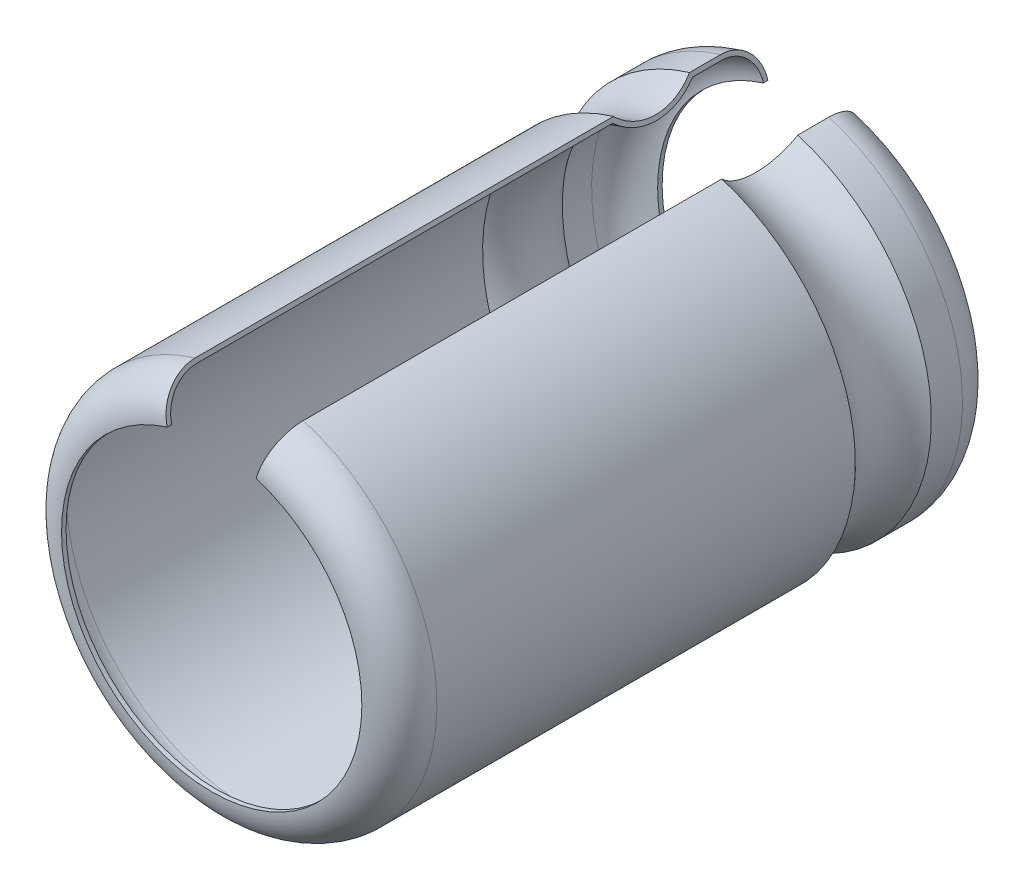
ISO-10303-21;
HEADER;
FILE_DESCRIPTION(('STEP AP214'),'2;1');
FILE_NAME('part.step','',(''),(''),'','','');
FILE_SCHEMA(('AUTOMOTIVE_DESIGN { 1 0 10303 214 1 1 1 1 }'));
ENDSEC;
DATA;
#1=APPLICATION_CONTEXT('core data for automotive mechanical design processes');
#2=APPLICATION_PROTOCOL_DEFINITION('international standard','automotive_design',2000,#1);
#3=PRODUCT_CONTEXT('',#1,'mechanical');
#4=PRODUCT('Part','Part','',(#3));
#5=PRODUCT_RELATED_PRODUCT_CATEGORY('part','',(#4));
#6=PRODUCT_DEFINITION_FORMATION('','',#4);
#7=PRODUCT_DEFINITION_CONTEXT('part definition',#1,'design');
#8=PRODUCT_DEFINITION('design','',#6,#7);
#9=PRODUCT_DEFINITION_SHAPE('','',#8);
#10=(LENGTH_UNIT() NAMED_UNIT(*) SI_UNIT(.MILLI.,.METRE.));
#11=(NAMED_UNIT(*) PLANE_ANGLE_UNIT() SI_UNIT($,.RADIAN.));
#12=(NAMED_UNIT(*) SI_UNIT($,.STERADIAN.) SOLID_ANGLE_UNIT());
#13=UNCERTAINTY_MEASURE_WITH_UNIT(LENGTH_MEASURE(1.E-05),#10,'distance_accuracy_value','');
#14=(GEOMETRIC_REPRESENTATION_CONTEXT(3) GLOBAL_UNCERTAINTY_ASSIGNED_CONTEXT((#13)) GLOBAL_UNIT_ASSIGNED_CONTEXT((#10,
#11,#12)) REPRESENTATION_CONTEXT('',''));
#15=CARTESIAN_POINT('',(0.,0.,0.));
#16=DIRECTION('',(0.,0.,1.));
#17=DIRECTION('',(1.,0.,0.));
#18=AXIS2_PLACEMENT_3D('',#15,#16,#17);
#19=CARTESIAN_POINT('',(-175.270710986926,-62.9180736437961,-7.00000000000005));
#20=DIRECTION('',(0.,0.,-1.));
#21=DIRECTION('',(-1.,0.,0.));
#22=AXIS2_PLACEMENT_3D('',#19,#20,#21);
#23=TOROIDAL_SURFACE('',#22,3.99999999999992,0.879999999999994);
#24=CARTESIAN_POINT('',(-174.086691240548,-59.0973280045019,-7.88000000000005));
#25=CARTESIAN_POINT('',(-174.073863625486,-59.049454693351,-7.88004200739849));
#26=CARTESIAN_POINT('',(-174.061039158918,-59.001593132538,-7.87582172400537));
#27=CARTESIAN_POINT('',(-174.035762350138,-58.907258797918,-7.8591646886519));
#28=CARTESIAN_POINT('',(-174.023309732605,-58.8607849966003,-7.84673418162917));
#29=CARTESIAN_POINT('',(-173.999115912304,-58.7704924300049,-7.81395587498221));
#30=CARTESIAN_POINT('',(-173.987375063362,-58.7266749852309,-7.79360417434748));
#31=CARTESIAN_POINT('',(-173.964946807082,-58.6429715932675,-7.74557704096647));
#32=CARTESIAN_POINT('',(-173.954259206179,-58.6030849236881,-7.7179029573711));
#33=CARTESIAN_POINT('',(-173.934243494534,-58.5283852708782,-7.65602370187232));
#34=CARTESIAN_POINT('',(-173.924914806908,-58.4935701346889,-7.62182131568306));
#35=CARTESIAN_POINT('',(-173.907875166683,-58.4299773316266,-7.54783977454284));
#36=CARTESIAN_POINT('',(-173.900164530168,-58.4012008443949,-7.50805953249298));
#37=CARTESIAN_POINT('',(-173.886585843482,-58.3505244957839,-7.42407942411352));
#38=CARTESIAN_POINT('',(-173.880717076708,-58.3286219600042,-7.37988128547069));
#39=CARTESIAN_POINT('',(-173.870987368497,-58.2923101946186,-7.28831316894348));
#40=CARTESIAN_POINT('',(-173.867125235586,-58.2778965183701,-7.24094509217138));
#41=CARTESIAN_POINT('',(-173.862482732615,-58.2605704614063,-7.16107038915282));
#42=CARTESIAN_POINT('',(-173.861099001353,-58.2554063060326,-7.12906788225587));
#43=CARTESIAN_POINT('',(-173.859253042378,-58.2485170933492,-7.06471473974938));
#44=CARTESIAN_POINT('',(-173.858789506993,-58.2467871557412,-7.03236466393462));
#45=CARTESIAN_POINT('',(-173.858790560804,-58.2467910886193,-7.00000000000003));
#46=B_SPLINE_CURVE_WITH_KNOTS('',3,(#24,#25,#26,#27,#28,#29,#30,#31,#32,#33,#34,#35,#36,#37,#38,
#39,#40,#41,#42,#43,#44,#45),.UNSPECIFIED.,.F.,.F.,(4,2,2,2,2,2,2,2,2,2,4),(0.,
0.148489542652124,0.296866269659267,0.445316161530129,0.593738720494428,0.742098086583743,
0.890486407537572,1.03881692430446,1.18705926626675,1.28421349755417,1.38122956579012),.UNSPECIFIED.);
#47=CARTESIAN_POINT('',(-174.086691240548,-59.0973280045019,-7.88000000000004));
#48=VERTEX_POINT('',#47);
#49=CARTESIAN_POINT('',(-173.858790560804,-58.2467910886192,-7.00000000000003));
#50=VERTEX_POINT('',#49);
#51=EDGE_CURVE('E120',#48,#50,#46,.T.);
#52=ORIENTED_EDGE('',*,*,#51,.F.);
#53=CARTESIAN_POINT('',(-175.270710986926,-62.9180736437962,-7.88000000000003));
#54=DIRECTION('',(0.,0.,-1.));
#55=DIRECTION('',(-1.,0.,0.));
#56=AXIS2_PLACEMENT_3D('',#53,#54,#55);
#57=CIRCLE('',#56,4.);
#58=CARTESIAN_POINT('',(-176.454730733284,-59.0973280044957,-7.88000000000003));
#59=VERTEX_POINT('',#58);
#60=EDGE_CURVE('E119',#48,#59,#57,.T.);
#61=ORIENTED_EDGE('',*,*,#60,.T.);
#62=CARTESIAN_POINT('',(-176.682631413028,-58.2467910886134,-7.00000000000003));
#63=CARTESIAN_POINT('',(-176.682642318182,-58.2467503900244,-7.04948823001555));
#64=CARTESIAN_POINT('',(-176.681551062634,-58.2508230111739,-7.09896377495482));
#65=CARTESIAN_POINT('',(-176.677244738356,-58.2668944321743,-7.19647661285873));
#66=CARTESIAN_POINT('',(-176.674031362662,-58.2788869135261,-7.24451502046828));
#67=CARTESIAN_POINT('',(-176.665559054278,-58.3105059988744,-7.33784616668078));
#68=CARTESIAN_POINT('',(-176.660299148075,-58.3301362360651,-7.38313758670326));
#69=CARTESIAN_POINT('',(-176.647887971262,-58.3764553785155,-7.46965947469887));
#70=CARTESIAN_POINT('',(-176.640737027326,-58.4031430646066,-7.51089064239059));
#71=CARTESIAN_POINT('',(-176.624744283447,-58.4628287973129,-7.58813912651197));
#72=CARTESIAN_POINT('',(-176.615902167139,-58.4958280246216,-7.62415546519043));
#73=CARTESIAN_POINT('',(-176.596777125269,-58.5672036525786,-7.68995197242969));
#74=CARTESIAN_POINT('',(-176.586493918243,-58.6055811036625,-7.71973091990715));
#75=CARTESIAN_POINT('',(-176.564774025416,-58.6866408472298,-7.77221846154539));
#76=CARTESIAN_POINT('',(-176.553336561274,-58.7293260445181,-7.79492224202426));
#77=CARTESIAN_POINT('',(-176.529640057157,-58.8177626018441,-7.83258200649675));
#78=CARTESIAN_POINT('',(-176.517381493887,-58.8635121827926,-7.84754244275786));
#79=CARTESIAN_POINT('',(-176.496662397353,-58.9408369037461,-7.86559434063956));
#80=CARTESIAN_POINT('',(-176.488331620019,-58.9719277880212,-7.87099330560158));
#81=CARTESIAN_POINT('',(-176.471578626774,-59.0344508099931,-7.87819567238095));
#82=CARTESIAN_POINT('',(-176.463156557916,-59.0658823988747,-7.88000418187417));
#83=CARTESIAN_POINT('',(-176.454730733284,-59.0973280044957,-7.88000000000005));
#84=B_SPLINE_CURVE_WITH_KNOTS('',3,(#62,#63,#64,#65,#66,#67,#68,#69,#70,#71,#72,#73,#74,#75,#76,
#77,#78,#79,#80,#81,#82,#83),.UNSPECIFIED.,.F.,.F.,(4,2,2,2,2,2,2,2,2,2,4),(0.,
0.148267203688105,0.296416261819587,0.44463587911513,0.592829908299395,0.741051687151812,
0.889302456061439,1.03765387020331,1.18591989023676,1.28364520176673,1.3812313922552),.UNSPECIFIED.);
#85=CARTESIAN_POINT('',(-176.682631413028,-58.2467910886134,-7.00000000000003));
#86=VERTEX_POINT('',#85);
#87=EDGE_CURVE('E30',#86,#59,#84,.T.);
#88=ORIENTED_EDGE('',*,*,#87,.F.);
#89=CARTESIAN_POINT('',(-175.270710986926,-62.9180736437962,-7.00000000000003));
#90=DIRECTION('',(0.,0.,1.));
#91=DIRECTION('',(1.,0.,0.));
#92=AXIS2_PLACEMENT_3D('',#89,#90,#91);
#93=CIRCLE('',#92,4.88);
#94=EDGE_CURVE('E111',#86,#50,#93,.T.);
#95=ORIENTED_EDGE('',*,*,#94,.T.);
#96=EDGE_LOOP('',(#52,#61,#88,#95));
#97=FACE_BOUND('',#96,.T.);
#98=ADVANCED_FACE('F25',(#97),#23,.F.);
#99=CARTESIAN_POINT('',(-175.270710986926,-62.9180736437962,-8.00000000000003));
#100=DIRECTION('',(0.,0.,-1.));
#101=DIRECTION('',(-1.,0.,0.));
#102=AXIS2_PLACEMENT_3D('',#99,#100,#101);
#103=CYLINDRICAL_SURFACE('',#102,4.);
#104=ORIENTED_EDGE('',*,*,#60,.F.);
#105=DIRECTION('',(0.,0.,-1.));
#106=VECTOR('',#105,1.);
#107=CARTESIAN_POINT('',(-174.086691240548,-59.0973280045019,-8.00000000000003));
#108=LINE('',#107,#106);
#109=CARTESIAN_POINT('',(-174.086691240548,-59.0973280045019,-8.00000000000004));
#110=VERTEX_POINT('',#109);
#111=EDGE_CURVE('E136',#110,#48,#108,.F.);
#112=ORIENTED_EDGE('',*,*,#111,.F.);
#113=CARTESIAN_POINT('',(-175.270710986926,-62.9180736437963,-8.00000000000003));
#114=DIRECTION('',(0.,0.,1.));
#115=DIRECTION('',(1.,0.,0.));
#116=AXIS2_PLACEMENT_3D('',#113,#114,#115);
#117=CIRCLE('',#116,3.99999999999997);
#118=CARTESIAN_POINT('',(-176.454730733284,-59.0973280044958,-8.00000000000003));
#119=VERTEX_POINT('',#118);
#120=EDGE_CURVE('E212',#119,#110,#117,.T.);
#121=ORIENTED_EDGE('',*,*,#120,.F.);
#122=DIRECTION('',(0.,0.,-1.));
#123=VECTOR('',#122,1.);
#124=CARTESIAN_POINT('',(-176.454730733284,-59.0973280044957,-8.00000000000003));
#125=LINE('',#124,#123);
#126=EDGE_CURVE('E131',#59,#119,#125,.T.);
#127=ORIENTED_EDGE('',*,*,#126,.F.);
#128=EDGE_LOOP('',(#104,#112,#121,#127));
#129=FACE_BOUND('',#128,.T.);
#130=ADVANCED_FACE('F225',(#129),#103,.F.);
#131=CARTESIAN_POINT('',(-175.270710986926,-62.9180736437962,-6.58570381824796));
#132=DIRECTION('',(0.,0.,1.));
#133=DIRECTION('',(1.,0.,0.));
#134=AXIS2_PLACEMENT_3D('',#131,#132,#133);
#135=CYLINDRICAL_SURFACE('',#134,4.88);
#136=ORIENTED_EDGE('',*,*,#94,.F.);
#137=DIRECTION('',(0.,0.,1.));
#138=VECTOR('',#137,1.);
#139=CARTESIAN_POINT('',(-176.682631413028,-58.2467910886133,-6.58570381824796));
#140=LINE('',#139,#138);
#141=CARTESIAN_POINT('',(-176.682631413028,-58.2467910886134,-6.22092476440515));
#142=VERTEX_POINT('',#141);
#143=EDGE_CURVE('E99',#142,#86,#140,.F.);
#144=ORIENTED_EDGE('',*,*,#143,.F.);
#145=CARTESIAN_POINT('',(-175.270710986926,-62.9180736437963,-6.22092476440518));
#146=DIRECTION('',(0.,0.,-1.));
#147=DIRECTION('',(-1.,0.,0.));
#148=AXIS2_PLACEMENT_3D('',#145,#146,#147);
#149=CIRCLE('',#148,4.88000000000003);
#150=CARTESIAN_POINT('',(-173.858790560804,-58.2467910886192,-6.22092476440514));
#151=VERTEX_POINT('',#150);
#152=EDGE_CURVE('E239',#151,#142,#149,.T.);
#153=ORIENTED_EDGE('',*,*,#152,.F.);
#154=DIRECTION('',(0.,0.,1.));
#155=VECTOR('',#154,1.);
#156=CARTESIAN_POINT('',(-173.858790560805,-58.2467910886192,-6.58570381824796));
#157=LINE('',#156,#155);
#158=EDGE_CURVE('E112',#50,#151,#157,.T.);
#159=ORIENTED_EDGE('',*,*,#158,.F.);
#160=EDGE_LOOP('',(#136,#144,#153,#159));
#161=FACE_BOUND('',#160,.T.);
#162=ADVANCED_FACE('F122',(#161),#135,.F.);
#163=CARTESIAN_POINT('',(-175.270710986926,-62.9180736437963,-7.00000000000005));
#164=DIRECTION('',(0.,0.,-1.));
#165=DIRECTION('',(-1.,0.,0.));
#166=AXIS2_PLACEMENT_3D('',#163,#164,#165);
#167=TOROIDAL_SURFACE('',#166,4.00000000000013,0.999999999999994);
#168=CARTESIAN_POINT('',(-176.713704959449,-58.1308230345987,-7.00000000000003));
#169=CARTESIAN_POINT('',(-176.713704912501,-58.1308232098109,-7.02812433998113));
#170=CARTESIAN_POINT('',(-176.71339753885,-58.1319703438928,-7.05623520346158));
#171=CARTESIAN_POINT('',(-176.712171310376,-58.1365466908591,-7.11225571089517));
#172=CARTESIAN_POINT('',(-176.711252485363,-58.1399757924928,-7.14016536459065));
#173=CARTESIAN_POINT('',(-176.707587608629,-58.1536532986658,-7.223243165599));
#174=CARTESIAN_POINT('',(-176.70393313073,-58.1672919958602,-7.27785472162927));
#175=CARTESIAN_POINT('',(-176.694303275295,-58.2032311056153,-7.38393046225344));
#176=CARTESIAN_POINT('',(-176.688326792564,-58.2255356428155,-7.43539313456653));
#177=CARTESIAN_POINT('',(-176.674223506791,-58.2781698218769,-7.53371093170297));
#178=CARTESIAN_POINT('',(-176.666097075601,-58.3084980759594,-7.58056685138785));
#179=CARTESIAN_POINT('',(-176.647923082565,-58.3763243413488,-7.66835109015507));
#180=CARTESIAN_POINT('',(-176.637875184854,-58.4138236061135,-7.70927837073872));
#181=CARTESIAN_POINT('',(-176.616141999698,-58.4949329573265,-7.78404665055555));
#182=CARTESIAN_POINT('',(-176.604456392658,-58.5385442365175,-7.81788626342708));
#183=CARTESIAN_POINT('',(-176.579774684644,-58.6306576248446,-7.87752981360219));
#184=CARTESIAN_POINT('',(-176.566777729135,-58.6791629231446,-7.90332846569758));
#185=CARTESIAN_POINT('',(-176.539850238682,-58.7796576856369,-7.9461215081207));
#186=CARTESIAN_POINT('',(-176.525920245407,-58.8316451282902,-7.96312095759089));
#187=CARTESIAN_POINT('',(-176.502376719704,-58.9195107624025,-7.98363233475662));
#188=CARTESIAN_POINT('',(-176.492910637277,-58.9548386629664,-7.98976663699543));
#189=CARTESIAN_POINT('',(-176.473874591828,-59.0258821517569,-7.99794994266552));
#190=CARTESIAN_POINT('',(-176.464304795921,-59.0615971163015,-8.00000475093719));
#191=CARTESIAN_POINT('',(-176.454730733284,-59.0973280044958,-8.00000000000005));
#192=B_SPLINE_CURVE_WITH_KNOTS('',3,(#168,#169,#170,#171,#172,#173,#174,#175,#176,#177,#178,
#179,#180,#181,#182,#183,#184,#185,#186,#187,#188,#189,#190,#191),.UNSPECIFIED.,.F.,.F.,(4,2,2,
2,2,2,2,2,2,2,2,4),(0.,0.0843211861221379,0.168638261715392,0.336992318190582,0.505426603721374,
0.673831775954315,0.842266411544934,1.01073396257453,1.1793120125265,1.34779302978182,
1.45883601184621,1.56972087378508),.UNSPECIFIED.);
#193=CARTESIAN_POINT('',(-176.713704959449,-58.1308230345987,-7.00000000000003));
#194=VERTEX_POINT('',#193);
#195=EDGE_CURVE('E127',#194,#119,#192,.T.);
#196=ORIENTED_EDGE('',*,*,#195,.T.);
#197=ORIENTED_EDGE('',*,*,#120,.T.);
#198=CARTESIAN_POINT('',(-174.086691240548,-59.0973280045019,-8.00000000000005));
#199=CARTESIAN_POINT('',(-174.079401507584,-59.0701223507088,-7.99999980415748));
#200=CARTESIAN_POINT('',(-174.072115261363,-59.0429297096156,-7.99881110448075));
#201=CARTESIAN_POINT('',(-174.057594854967,-58.9887388151971,-7.99406861173342));
#202=CARTESIAN_POINT('',(-174.050360692451,-58.9617405531373,-7.99051492561371));
#203=CARTESIAN_POINT('',(-174.028826364622,-58.8813733475726,-7.97633947447154));
#204=CARTESIAN_POINT('',(-174.014670368976,-58.8285424525889,-7.9622032264789));
#205=CARTESIAN_POINT('',(-173.987173862864,-58.7259240947479,-7.92494796601356));
#206=CARTESIAN_POINT('',(-173.973833758433,-58.6761381472347,-7.9018245224137));
#207=CARTESIAN_POINT('',(-173.948348730164,-58.5810267269034,-7.84725154706696));
#208=CARTESIAN_POINT('',(-173.936203586531,-58.5357004338004,-7.81580355043581));
#209=CARTESIAN_POINT('',(-173.913458740099,-58.4508155113041,-7.7454872826941));
#210=CARTESIAN_POINT('',(-173.902858370309,-58.4112543926685,-7.70662223090349));
#211=CARTESIAN_POINT('',(-173.883495746046,-58.3389920951521,-7.62255489698594));
#212=CARTESIAN_POINT('',(-173.874733850918,-58.3062922573649,-7.5773513788289));
#213=CARTESIAN_POINT('',(-173.859303700553,-58.2487061522316,-7.48192162116973));
#214=CARTESIAN_POINT('',(-173.852634663545,-58.2238169672808,-7.43169726642555));
#215=CARTESIAN_POINT('',(-173.841578106573,-58.1825533349041,-7.32764423434533));
#216=CARTESIAN_POINT('',(-173.837189233375,-58.1661738371435,-7.2738177162862));
#217=CARTESIAN_POINT('',(-173.831913234996,-58.1464835431306,-7.18304906233767));
#218=CARTESIAN_POINT('',(-173.830340599032,-58.1406143858132,-7.14667971981237));
#219=CARTESIAN_POINT('',(-173.828242633157,-58.1327846705723,-7.07354535307093));
#220=CARTESIAN_POINT('',(-173.827715817003,-58.1308185659209,-7.03678096512884));
#221=CARTESIAN_POINT('',(-173.827717014383,-58.1308230346046,-7.00000000000003));
#222=B_SPLINE_CURVE_WITH_KNOTS('',3,(#198,#199,#200,#201,#202,#203,#204,#205,#206,#207,#208,
#209,#210,#211,#212,#213,#214,#215,#216,#217,#218,#219,#220,#221),.UNSPECIFIED.,.F.,.F.,(4,2,2,
2,2,2,2,2,2,2,2,4),(0.,0.0844442471412552,0.168884675751706,0.33749099922511,0.506180559540304,
0.674839033764523,0.843424468793357,1.01204282459535,1.18059811922393,1.34905326494285,
1.45946462137824,1.56971895676037),.UNSPECIFIED.);
#223=CARTESIAN_POINT('',(-173.827717014383,-58.1308230346046,-7.00000000000003));
#224=VERTEX_POINT('',#223);
#225=EDGE_CURVE('E124',#110,#224,#222,.T.);
#226=ORIENTED_EDGE('',*,*,#225,.T.);
#227=CARTESIAN_POINT('',(-175.270710986926,-62.9180736437962,-7.00000000000003));
#228=DIRECTION('',(0.,0.,1.));
#229=DIRECTION('',(1.,0.,0.));
#230=AXIS2_PLACEMENT_3D('',#227,#228,#229);
#231=CIRCLE('',#230,5.);
#232=EDGE_CURVE('E242',#194,#224,#231,.T.);
#233=ORIENTED_EDGE('',*,*,#232,.F.);
#234=EDGE_LOOP('',(#196,#197,#226,#233));
#235=FACE_BOUND('',#234,.T.);
#236=ADVANCED_FACE('F216',(#235),#167,.T.);
#237=CARTESIAN_POINT('',(-175.270710986926,-62.9180736437962,1.4268228248373));
#238=DIRECTION('',(0.,0.,1.));
#239=DIRECTION('',(1.,0.,0.));
#240=AXIS2_PLACEMENT_3D('',#237,#238,#239);
#241=CYLINDRICAL_SURFACE('',#240,4.88);
#242=CARTESIAN_POINT('',(-175.270710986926,-62.9180736437963,-4.096837222416));
#243=DIRECTION('',(0.,0.,1.));
#244=DIRECTION('',(0.,-1.,0.));
#245=AXIS2_PLACEMENT_3D('',#242,#243,#244);
#246=CIRCLE('',#245,4.88000000000008);
#247=CARTESIAN_POINT('',(-176.682631413028,-58.2467910886133,-4.09683722241601));
#248=VERTEX_POINT('',#247);
#249=CARTESIAN_POINT('',(-173.858790560804,-58.2467910886193,-4.09683722241604));
#250=VERTEX_POINT('',#249);
#251=EDGE_CURVE('E248',#248,#250,#246,.T.);
#252=ORIENTED_EDGE('',*,*,#251,.F.);
#253=DIRECTION('',(0.,0.,1.));
#254=VECTOR('',#253,1.);
#255=CARTESIAN_POINT('',(-176.682631413028,-58.2467910886132,0.));
#256=LINE('',#255,#254);
#257=CARTESIAN_POINT('',(-176.682631413028,-58.2467910886132,6.99999999999997));
#258=VERTEX_POINT('',#257);
#259=EDGE_CURVE('E185',#248,#258,#256,.T.);
#260=ORIENTED_EDGE('',*,*,#259,.T.);
#261=CARTESIAN_POINT('',(-175.270710986926,-62.9180736437962,6.99999999999997));
#262=DIRECTION('',(0.,0.,1.));
#263=DIRECTION('',(1.,0.,0.));
#264=AXIS2_PLACEMENT_3D('',#261,#262,#263);
#265=CIRCLE('',#264,4.88000000000001);
#266=CARTESIAN_POINT('',(-173.858790560804,-58.2467910886193,6.99999999999997));
#267=VERTEX_POINT('',#266);
#268=EDGE_CURVE('E244',#258,#267,#265,.T.);
#269=ORIENTED_EDGE('',*,*,#268,.T.);
#270=DIRECTION('',(0.,0.,1.));
#271=VECTOR('',#270,1.);
#272=CARTESIAN_POINT('',(-173.858790560804,-58.2467910886193,0.));
#273=LINE('',#272,#271);
#274=EDGE_CURVE('E275',#267,#250,#273,.F.);
#275=ORIENTED_EDGE('',*,*,#274,.T.);
#276=EDGE_LOOP('',(#252,#260,#269,#275));
#277=FACE_BOUND('',#276,.T.);
#278=ADVANCED_FACE('F219',(#277),#241,.F.);
#279=CARTESIAN_POINT('',(-175.270710986926,-62.9180736437963,-5.15888099341059));
#280=DIRECTION('',(0.,0.,-1.));
#281=DIRECTION('',(0.,1.,0.));
#282=AXIS2_PLACEMENT_3D('',#279,#280,#281);
#283=TOROIDAL_SURFACE('',#282,5.98358245611314,1.53161065840792);
#284=CARTESIAN_POINT('',(-176.682631413028,-58.2467910886133,-6.22092476440514));
#285=CARTESIAN_POINT('',(-176.674896646948,-58.2756576286105,-6.18988626640525));
#286=CARTESIAN_POINT('',(-176.667504556927,-58.3032452841421,-6.1576015652313));
#287=CARTESIAN_POINT('',(-176.653450210404,-58.3556968194331,-6.09074443535141));
#288=CARTESIAN_POINT('',(-176.646787920995,-58.3805608220026,-6.05617210990781));
#289=CARTESIAN_POINT('',(-176.627981696227,-58.4507466083331,-5.9494411151239));
#290=CARTESIAN_POINT('',(-176.616993190959,-58.4917562682951,-5.87416705473672));
#291=CARTESIAN_POINT('',(-176.598443621592,-58.5609842036307,-5.71755951620225));
#292=CARTESIAN_POINT('',(-176.590884262409,-58.5891961161722,-5.63622304727041));
#293=CARTESIAN_POINT('',(-176.579408506254,-58.632024221199,-5.46980669653876));
#294=CARTESIAN_POINT('',(-176.575491351523,-58.646643241677,-5.38472759725025));
#295=CARTESIAN_POINT('',(-176.571412229119,-58.6618667337368,-5.2132732869784));
#296=CARTESIAN_POINT('',(-176.571248778512,-58.6624767397088,-5.12689860132365));
#297=CARTESIAN_POINT('',(-176.574678352238,-58.6496773963152,-4.95524266283));
#298=CARTESIAN_POINT('',(-176.578272410452,-58.6362641884558,-4.86996171747152));
#299=CARTESIAN_POINT('',(-176.589114764327,-58.595799972919,-4.70293912494842));
#300=CARTESIAN_POINT('',(-176.596363578787,-58.5687470290609,-4.62119798205331));
#301=CARTESIAN_POINT('',(-176.614309494438,-58.5017719600606,-4.46361671458232));
#302=CARTESIAN_POINT('',(-176.625003592985,-58.4618610409423,-4.38777152273443));
#303=CARTESIAN_POINT('',(-176.643936792976,-58.3912013766277,-4.27683559150289));
#304=CARTESIAN_POINT('',(-176.651081684526,-58.3645362783463,-4.23889289693568));
#305=CARTESIAN_POINT('',(-176.666227644852,-58.3080107848804,-4.16575746546499));
#306=CARTESIAN_POINT('',(-176.674227222822,-58.2781559534585,-4.13056011967778));
#307=CARTESIAN_POINT('',(-176.682631413028,-58.2467910886133,-4.096837222416));
#308=B_SPLINE_CURVE_WITH_KNOTS('',3,(#284,#285,#286,#287,#288,#289,#290,#291,#292,#293,#294,
#295,#296,#297,#298,#299,#300,#301,#302,#303,#304,#305,#306,#307),.UNSPECIFIED.,.F.,.F.,(4,2,2,
2,2,2,2,2,2,2,2,4),(0.,0.129181778596857,0.258357729957649,0.516293219033621,0.774356809267518,
1.03236669751023,1.29027465481587,1.54825359429622,1.80626916458169,2.06406047387028,
2.20465287516868,2.3450039295013),.UNSPECIFIED.);
#309=EDGE_CURVE('E106',#142,#248,#308,.T.);
#310=ORIENTED_EDGE('',*,*,#309,.T.);
#311=ORIENTED_EDGE('',*,*,#251,.T.);
#312=CARTESIAN_POINT('',(-173.858790560804,-58.2467910886193,-4.09683722241605));
#313=CARTESIAN_POINT('',(-173.866525326885,-58.2756576286165,-4.12787572041594));
#314=CARTESIAN_POINT('',(-173.873917416906,-58.3032452841481,-4.16016042158988));
#315=CARTESIAN_POINT('',(-173.887971763429,-58.355696819439,-4.22701755146977));
#316=CARTESIAN_POINT('',(-173.894634052838,-58.3805608220085,-4.26158987691336));
#317=CARTESIAN_POINT('',(-173.913440277605,-58.4507466083391,-4.36832087169726));
#318=CARTESIAN_POINT('',(-173.924428782874,-58.4917562683011,-4.44359493208445));
#319=CARTESIAN_POINT('',(-173.942978352241,-58.5609842036367,-4.6002024706189));
#320=CARTESIAN_POINT('',(-173.950537711423,-58.5891961161782,-4.68153893955074));
#321=CARTESIAN_POINT('',(-173.962013467578,-58.632024221205,-4.84795529028238));
#322=CARTESIAN_POINT('',(-173.96593062231,-58.646643241683,-4.93303438957089));
#323=CARTESIAN_POINT('',(-173.970009744713,-58.6618667337428,-5.10448869984273));
#324=CARTESIAN_POINT('',(-173.970173195321,-58.6624767397149,-5.19086338549747));
#325=CARTESIAN_POINT('',(-173.966743621595,-58.6496773963213,-5.3625193239911));
#326=CARTESIAN_POINT('',(-173.963149563381,-58.6362641884619,-5.44780026934957));
#327=CARTESIAN_POINT('',(-173.952307209505,-58.595799972925,-5.61482286187264));
#328=CARTESIAN_POINT('',(-173.945058395046,-58.5687470290669,-5.69656400476774));
#329=CARTESIAN_POINT('',(-173.927112479394,-58.5017719600667,-5.85414527223871));
#330=CARTESIAN_POINT('',(-173.916418380847,-58.4618610409484,-5.92999046408658));
#331=CARTESIAN_POINT('',(-173.897485180857,-58.3912013766338,-6.04092639531815));
#332=CARTESIAN_POINT('',(-173.890340289306,-58.3645362783523,-6.07886908988538));
#333=CARTESIAN_POINT('',(-173.87519432898,-58.3080107848864,-6.15200452135612));
#334=CARTESIAN_POINT('',(-173.86719475101,-58.2781559534645,-6.18720186714335));
#335=CARTESIAN_POINT('',(-173.858790560804,-58.2467910886192,-6.22092476440515));
#336=B_SPLINE_CURVE_WITH_KNOTS('',3,(#312,#313,#314,#315,#316,#317,#318,#319,#320,#321,#322,
#323,#324,#325,#326,#327,#328,#329,#330,#331,#332,#333,#334,#335),.UNSPECIFIED.,.F.,.F.,(4,2,2,
2,2,2,2,2,2,2,2,4),(0.,0.129181778596854,0.258357729957643,0.516293219033608,0.774356809267499,
1.03236669751021,1.29027465481582,1.54825359429614,1.80626916458156,2.06406047387011,
2.2046528751686,2.34500392950131),.UNSPECIFIED.);
#337=EDGE_CURVE('E278',#250,#151,#336,.T.);
#338=ORIENTED_EDGE('',*,*,#337,.T.);
#339=ORIENTED_EDGE('',*,*,#152,.T.);
#340=EDGE_LOOP('',(#310,#311,#338,#339));
#341=FACE_BOUND('',#340,.T.);
#342=ADVANCED_FACE('F167',(#341),#283,.T.);
#343=CARTESIAN_POINT('',(-175.270710986926,-62.9180736437962,6.99999999999997));
#344=DIRECTION('',(0.,0.,-1.));
#345=DIRECTION('',(-1.,0.,0.));
#346=AXIS2_PLACEMENT_3D('',#343,#344,#345);
#347=TOROIDAL_SURFACE('',#346,4.,0.880000000000001);
#348=ORIENTED_EDGE('',*,*,#268,.F.);
#349=CARTESIAN_POINT('',(-176.682631413028,-58.2467910886132,6.99999999999998));
#350=CARTESIAN_POINT('',(-176.682642318182,-58.2467503900242,7.0494882300155));
#351=CARTESIAN_POINT('',(-176.681551062634,-58.2508230111737,7.09896377495478));
#352=CARTESIAN_POINT('',(-176.677244738355,-58.2668944321742,7.19647661285868));
#353=CARTESIAN_POINT('',(-176.674031362662,-58.2788869135259,7.24451502046823));
#354=CARTESIAN_POINT('',(-176.665559054277,-58.3105059988742,7.33784616668074));
#355=CARTESIAN_POINT('',(-176.660299148075,-58.330136236065,7.38313758670321));
#356=CARTESIAN_POINT('',(-176.647887971261,-58.3764553785154,7.46965947469883));
#357=CARTESIAN_POINT('',(-176.640737027325,-58.4031430646065,7.51089064239055));
#358=CARTESIAN_POINT('',(-176.624744283447,-58.4628287973127,7.58813912651191));
#359=CARTESIAN_POINT('',(-176.615902167139,-58.4958280246215,7.62415546519038));
#360=CARTESIAN_POINT('',(-176.596777125268,-58.5672036525784,7.68995197242963));
#361=CARTESIAN_POINT('',(-176.586493918243,-58.6055811036624,7.71973091990709));
#362=CARTESIAN_POINT('',(-176.564774025415,-58.6866408472297,7.77221846154533));
#363=CARTESIAN_POINT('',(-176.553336561273,-58.7293260445179,7.79492224202419));
#364=CARTESIAN_POINT('',(-176.529640057156,-58.817762601844,7.83258200649669));
#365=CARTESIAN_POINT('',(-176.517381493887,-58.8635121827925,7.8475424427578));
#366=CARTESIAN_POINT('',(-176.496662397352,-58.9408369037459,7.86559434063949));
#367=CARTESIAN_POINT('',(-176.488331620019,-58.971927788021,7.87099330560151));
#368=CARTESIAN_POINT('',(-176.471578626773,-59.0344508099929,7.87819567238088));
#369=CARTESIAN_POINT('',(-176.463156557916,-59.0658823988745,7.88000418187409));
#370=CARTESIAN_POINT('',(-176.454730733284,-59.0973280044956,7.87999999999997));
#371=B_SPLINE_CURVE_WITH_KNOTS('',3,(#349,#350,#351,#352,#353,#354,#355,#356,#357,#358,#359,
#360,#361,#362,#363,#364,#365,#366,#367,#368,#369,#370),.UNSPECIFIED.,.F.,.F.,(4,2,2,2,2,2,2,2,
2,2,4),(0.,0.148267203688108,0.296416261819591,0.444635879115135,0.592829908299406,
0.741051687151807,0.889302456061445,1.0376538702033,1.18591989023677,1.28364520176672,
1.38123139225518),.UNSPECIFIED.);
#372=CARTESIAN_POINT('',(-176.454730733284,-59.0973280044956,7.87999999999997));
#373=VERTEX_POINT('',#372);
#374=EDGE_CURVE('E179',#258,#373,#371,.T.);
#375=ORIENTED_EDGE('',*,*,#374,.T.);
#376=CARTESIAN_POINT('',(-175.270710986926,-62.9180736437962,7.87999999999997));
#377=DIRECTION('',(0.,0.,1.));
#378=DIRECTION('',(1.,0.,0.));
#379=AXIS2_PLACEMENT_3D('',#376,#377,#378);
#380=CIRCLE('',#379,4.);
#381=CARTESIAN_POINT('',(-174.086691240548,-59.0973280045019,7.87999999999997));
#382=VERTEX_POINT('',#381);
#383=EDGE_CURVE('E259',#373,#382,#380,.T.);
#384=ORIENTED_EDGE('',*,*,#383,.T.);
#385=CARTESIAN_POINT('',(-174.086691240548,-59.0973280045019,7.87999999999997));
#386=CARTESIAN_POINT('',(-174.073863625486,-59.049454693351,7.88004200739841));
#387=CARTESIAN_POINT('',(-174.061039158918,-59.001593132538,7.87582172400529));
#388=CARTESIAN_POINT('',(-174.035762350138,-58.9072587979179,7.85916468865182));
#389=CARTESIAN_POINT('',(-174.023309732605,-58.8607849966003,7.84673418162909));
#390=CARTESIAN_POINT('',(-173.999115912304,-58.7704924300049,7.81395587498213));
#391=CARTESIAN_POINT('',(-173.987375063362,-58.7266749852308,7.7936041743474));
#392=CARTESIAN_POINT('',(-173.964946807082,-58.6429715932675,7.74557704096639));
#393=CARTESIAN_POINT('',(-173.954259206179,-58.6030849236881,7.71790295737102));
#394=CARTESIAN_POINT('',(-173.934243494534,-58.5283852708782,7.65602370187222));
#395=CARTESIAN_POINT('',(-173.924914806908,-58.4935701346889,7.62182131568296));
#396=CARTESIAN_POINT('',(-173.907875166683,-58.4299773316265,7.54783977454275));
#397=CARTESIAN_POINT('',(-173.900164530168,-58.4012008443949,7.50805953249289));
#398=CARTESIAN_POINT('',(-173.886585843482,-58.3505244957839,7.42407942411343));
#399=CARTESIAN_POINT('',(-173.880717076708,-58.3286219600042,7.37988128547059));
#400=CARTESIAN_POINT('',(-173.870987368497,-58.2923101946185,7.28831316894338));
#401=CARTESIAN_POINT('',(-173.867125235586,-58.2778965183701,7.24094509217128));
#402=CARTESIAN_POINT('',(-173.862482732615,-58.2605704614063,7.16107038915272));
#403=CARTESIAN_POINT('',(-173.861099001353,-58.2554063060326,7.12906788225578));
#404=CARTESIAN_POINT('',(-173.859253042378,-58.2485170933492,7.0647147397493));
#405=CARTESIAN_POINT('',(-173.858789506993,-58.2467871557412,7.03236466393456));
#406=CARTESIAN_POINT('',(-173.858790560804,-58.2467910886193,6.99999999999997));
#407=B_SPLINE_CURVE_WITH_KNOTS('',3,(#385,#386,#387,#388,#389,#390,#391,#392,#393,#394,#395,
#396,#397,#398,#399,#400,#401,#402,#403,#404,#405,#406),.UNSPECIFIED.,.F.,.F.,(4,2,2,2,2,2,2,2,
2,2,4),(0.,0.148489542652117,0.296866269659274,0.445316161530138,0.593738720494441,
0.742098086583767,0.890486407537583,1.03881692430448,1.18705926626677,1.28421349755417,
1.38122956579011),.UNSPECIFIED.);
#408=EDGE_CURVE('E173',#382,#267,#407,.T.);
#409=ORIENTED_EDGE('',*,*,#408,.T.);
#410=EDGE_LOOP('',(#348,#375,#384,#409));
#411=FACE_BOUND('',#410,.T.);
#412=ADVANCED_FACE('F161',(#411),#347,.F.);
#413=CARTESIAN_POINT('',(-175.270710986926,-62.9180736437962,-6.58570381824796));
#414=DIRECTION('',(0.,0.,1.));
#415=DIRECTION('',(1.,0.,0.));
#416=AXIS2_PLACEMENT_3D('',#413,#414,#415);
#417=CYLINDRICAL_SURFACE('',#416,5.);
#418=CARTESIAN_POINT('',(-175.270710986926,-62.9180736437962,-6.1714076364959));
#419=DIRECTION('',(0.,0.,-1.));
#420=DIRECTION('',(-1.,0.,0.));
#421=AXIS2_PLACEMENT_3D('',#418,#419,#420);
#422=CIRCLE('',#421,5.00000000000001);
#423=CARTESIAN_POINT('',(-173.827717014383,-58.1308230346047,-6.17140763649587));
#424=VERTEX_POINT('',#423);
#425=CARTESIAN_POINT('',(-176.713704959449,-58.1308230345987,-6.17140763649588));
#426=VERTEX_POINT('',#425);
#427=EDGE_CURVE('E281',#424,#426,#422,.T.);
#428=ORIENTED_EDGE('',*,*,#427,.T.);
#429=DIRECTION('',(0.,0.,1.));
#430=VECTOR('',#429,1.);
#431=CARTESIAN_POINT('',(-176.713704959449,-58.1308230345986,0.));
#432=LINE('',#431,#430);
#433=EDGE_CURVE('E264',#426,#194,#432,.F.);
#434=ORIENTED_EDGE('',*,*,#433,.T.);
#435=ORIENTED_EDGE('',*,*,#232,.T.);
#436=DIRECTION('',(0.,0.,1.));
#437=VECTOR('',#436,1.);
#438=CARTESIAN_POINT('',(-173.827717014383,-58.1308230346046,0.));
#439=LINE('',#438,#437);
#440=EDGE_CURVE('E184',#224,#424,#439,.T.);
#441=ORIENTED_EDGE('',*,*,#440,.T.);
#442=EDGE_LOOP('',(#428,#434,#435,#441));
#443=FACE_BOUND('',#442,.T.);
#444=ADVANCED_FACE('F166',(#443),#417,.T.);
#445=CARTESIAN_POINT('',(-175.555912966227,-62.4517615778958,0.));
#446=DIRECTION('',(-0.965925826289014,-0.258819045102723,0.));
#447=DIRECTION('',(0.258819045102723,-0.965925826289014,0.));
#448=AXIS2_PLACEMENT_3D('',#445,#446,#447);
#449=PLANE('',#448);
#450=ORIENTED_EDGE('',*,*,#259,.F.);
#451=ORIENTED_EDGE('',*,*,#309,.F.);
#452=ORIENTED_EDGE('',*,*,#143,.T.);
#453=ORIENTED_EDGE('',*,*,#87,.T.);
#454=ORIENTED_EDGE('',*,*,#126,.T.);
#455=ORIENTED_EDGE('',*,*,#195,.F.);
#456=ORIENTED_EDGE('',*,*,#433,.F.);
#457=CARTESIAN_POINT('',(-176.713704959449,-58.1308230345987,-6.17140763649588));
#458=CARTESIAN_POINT('',(-176.706330561043,-58.158344664124,-6.1437425267637));
#459=CARTESIAN_POINT('',(-176.69926183694,-58.1847255016239,-6.11488830852032));
#460=CARTESIAN_POINT('',(-176.685778354512,-58.2350465431069,-6.05498491061087));
#461=CARTESIAN_POINT('',(-176.679363566565,-58.2589868576433,-6.02393583047797));
#462=CARTESIAN_POINT('',(-176.661183012832,-58.3268376078871,-5.92787263211258));
#463=CARTESIAN_POINT('',(-176.650456534384,-58.3668693704421,-5.85985038053835));
#464=CARTESIAN_POINT('',(-176.632112113167,-58.4353316824579,-5.71781390263049));
#465=CARTESIAN_POINT('',(-176.624495700649,-58.4637565209465,-5.64379674802716));
#466=CARTESIAN_POINT('',(-176.612588165981,-58.5081960453216,-5.49187451416796));
#467=CARTESIAN_POINT('',(-176.608296489948,-58.5242127983253,-5.41397008481294));
#468=CARTESIAN_POINT('',(-176.603161947896,-58.5433751701379,-5.25651228944308));
#469=CARTESIAN_POINT('',(-176.602317917365,-58.5465251349604,-5.17695948932493));
#470=CARTESIAN_POINT('',(-176.604099305353,-58.5398769044832,-5.01842289060071));
#471=CARTESIAN_POINT('',(-176.606725204765,-58.5300769144599,-4.93943917238864));
#472=CARTESIAN_POINT('',(-176.615371198947,-58.4978096248918,-4.78430696841367));
#473=CARTESIAN_POINT('',(-176.621391060274,-58.4753431965658,-4.70815828803612));
#474=CARTESIAN_POINT('',(-176.636654245961,-58.4183802120959,-4.56085744760815));
#475=CARTESIAN_POINT('',(-176.645896347918,-58.3838882180215,-4.48970340505074));
#476=CARTESIAN_POINT('',(-176.664591748343,-58.3141160337708,-4.37171805529188));
#477=CARTESIAN_POINT('',(-176.673388985044,-58.2812842994366,-4.32331425570183));
#478=CARTESIAN_POINT('',(-176.692468097202,-58.2100800834979,-4.23117614003493));
#479=CARTESIAN_POINT('',(-176.702748400082,-58.1717134708329,-4.18743696218633));
#480=CARTESIAN_POINT('',(-176.713704959449,-58.1308230345987,-4.14635435032532));
#481=B_SPLINE_CURVE_WITH_KNOTS('',3,(#457,#458,#459,#460,#461,#462,#463,#464,#465,#466,#467,
#468,#469,#470,#471,#472,#473,#474,#475,#476,#477,#478,#479,#480),.UNSPECIFIED.,.F.,.F.,(4,2,2,
2,2,2,2,2,2,2,2,4),(0.,0.119068077119062,0.238130758167899,0.475864602356633,0.713715278542001,
0.951526321618083,1.18925703264152,1.42702069402654,1.6647680036258,1.90242521836216,
2.07942008039479,2.25622862588698),.UNSPECIFIED.);
#482=CARTESIAN_POINT('',(-176.713704959449,-58.1308230345986,-4.14635435032531));
#483=VERTEX_POINT('',#482);
#484=EDGE_CURVE('E147',#426,#483,#481,.T.);
#485=ORIENTED_EDGE('',*,*,#484,.T.);
#486=DIRECTION('',(0.,0.,1.));
#487=VECTOR('',#486,1.);
#488=CARTESIAN_POINT('',(-176.713704959449,-58.1308230345986,1.4268228248373));
#489=LINE('',#488,#487);
#490=CARTESIAN_POINT('',(-176.713704959449,-58.1308230345986,6.99999999999997));
#491=VERTEX_POINT('',#490);
#492=EDGE_CURVE('E262',#491,#483,#489,.F.);
#493=ORIENTED_EDGE('',*,*,#492,.F.);
#494=CARTESIAN_POINT('',(-176.454730733284,-59.0973280044956,7.99999999999998));
#495=CARTESIAN_POINT('',(-176.462020466247,-59.0701223507025,7.99999980415741));
#496=CARTESIAN_POINT('',(-176.469306712468,-59.0429297096093,7.99881110448068));
#497=CARTESIAN_POINT('',(-176.483827118865,-58.9887388151908,7.99406861173335));
#498=CARTESIAN_POINT('',(-176.491061281381,-58.9617405531311,7.99051492561364));
#499=CARTESIAN_POINT('',(-176.51259560921,-58.8813733475664,7.97633947447148));
#500=CARTESIAN_POINT('',(-176.526751604856,-58.8285424525827,7.96220322647884));
#501=CARTESIAN_POINT('',(-176.554248110968,-58.7259240947417,7.9249479660135));
#502=CARTESIAN_POINT('',(-176.567588215399,-58.6761381472285,7.90182452241365));
#503=CARTESIAN_POINT('',(-176.593073243668,-58.5810267268973,7.84725154706693));
#504=CARTESIAN_POINT('',(-176.605218387301,-58.5357004337943,7.81580355043578));
#505=CARTESIAN_POINT('',(-176.627963233733,-58.4508155112981,7.7454872826941));
#506=CARTESIAN_POINT('',(-176.638563603523,-58.4112543926625,7.70662223090349));
#507=CARTESIAN_POINT('',(-176.657926227786,-58.3389920951461,7.62255489698596));
#508=CARTESIAN_POINT('',(-176.666688122914,-58.3062922573589,7.57735137882893));
#509=CARTESIAN_POINT('',(-176.682118273279,-58.2487061522256,7.48192162116978));
#510=CARTESIAN_POINT('',(-176.688787310287,-58.2238169672748,7.4316972664256));
#511=CARTESIAN_POINT('',(-176.699843867259,-58.1825533348981,7.32764423434539));
#512=CARTESIAN_POINT('',(-176.704232740457,-58.1661738371375,7.27381771628626));
#513=CARTESIAN_POINT('',(-176.709508738836,-58.1464835431246,7.18304906233772));
#514=CARTESIAN_POINT('',(-176.7110813748,-58.1406143858071,7.14667971981239));
#515=CARTESIAN_POINT('',(-176.713179340675,-58.1327846705663,7.07354535307092));
#516=CARTESIAN_POINT('',(-176.713706156829,-58.1308185659149,7.0367809651288));
#517=CARTESIAN_POINT('',(-176.713704959449,-58.1308230345986,6.99999999999997));
#518=B_SPLINE_CURVE_WITH_KNOTS('',3,(#494,#495,#496,#497,#498,#499,#500,#501,#502,#503,#504,
#505,#506,#507,#508,#509,#510,#511,#512,#513,#514,#515,#516,#517),.UNSPECIFIED.,.F.,.F.,(4,2,2,
2,2,2,2,2,2,2,2,4),(0.,0.084444247141229,0.168884675751653,0.337490999225005,0.506180559540129,
0.674839033764309,0.843424468793112,1.01204282459506,1.18059811922363,1.34905326494255,
1.459464621378,1.56971895676019),.UNSPECIFIED.);
#519=CARTESIAN_POINT('',(-176.454730733284,-59.0973280044956,7.99999999999998));
#520=VERTEX_POINT('',#519);
#521=EDGE_CURVE('E203',#520,#491,#518,.T.);
#522=ORIENTED_EDGE('',*,*,#521,.F.);
#523=DIRECTION('',(0.,0.,1.));
#524=VECTOR('',#523,1.);
#525=CARTESIAN_POINT('',(-176.454730733284,-59.0973280044956,8.15006590889928));
#526=LINE('',#525,#524);
#527=EDGE_CURVE('E263',#520,#373,#526,.F.);
#528=ORIENTED_EDGE('',*,*,#527,.T.);
#529=ORIENTED_EDGE('',*,*,#374,.F.);
#530=EDGE_LOOP('',(#450,#451,#452,#453,#454,#455,#456,#485,#493,#522,#528,#529));
#531=FACE_BOUND('',#530,.T.);
#532=ADVANCED_FACE('F102',(#531),#449,.F.);
#533=CARTESIAN_POINT('',(-175.121191934087,-62.9581371532573,0.));
#534=DIRECTION('',(0.9659258262891,-0.258819045102401,0.));
#535=DIRECTION('',(0.258819045102401,0.9659258262891,0.));
#536=AXIS2_PLACEMENT_3D('',#533,#534,#535);
#537=PLANE('',#536);
#538=ORIENTED_EDGE('',*,*,#51,.T.);
#539=ORIENTED_EDGE('',*,*,#158,.T.);
#540=ORIENTED_EDGE('',*,*,#337,.F.);
#541=ORIENTED_EDGE('',*,*,#274,.F.);
#542=ORIENTED_EDGE('',*,*,#408,.F.);
#543=DIRECTION('',(0.,0.,1.));
#544=VECTOR('',#543,1.);
#545=CARTESIAN_POINT('',(-174.086691240548,-59.0973280045019,8.15006590889928));
#546=LINE('',#545,#544);
#547=CARTESIAN_POINT('',(-174.086691240548,-59.0973280045019,7.99999999999998));
#548=VERTEX_POINT('',#547);
#549=EDGE_CURVE('E286',#382,#548,#546,.T.);
#550=ORIENTED_EDGE('',*,*,#549,.T.);
#551=CARTESIAN_POINT('',(-173.827717014383,-58.1308230346046,6.99999999999997));
#552=CARTESIAN_POINT('',(-173.827717061331,-58.1308232098168,7.02812433998106));
#553=CARTESIAN_POINT('',(-173.828024434982,-58.1319703438987,7.05623520346151));
#554=CARTESIAN_POINT('',(-173.829250663456,-58.1365466908649,7.11225571089509));
#555=CARTESIAN_POINT('',(-173.83016948847,-58.1399757924987,7.14016536459057));
#556=CARTESIAN_POINT('',(-173.833834365203,-58.1536532986717,7.22324316559891));
#557=CARTESIAN_POINT('',(-173.837488843102,-58.1672919958661,7.27785472162917));
#558=CARTESIAN_POINT('',(-173.847118698538,-58.2032311056211,7.38393046225333));
#559=CARTESIAN_POINT('',(-173.853095181268,-58.2255356428214,7.43539313456642));
#560=CARTESIAN_POINT('',(-173.867198467042,-58.2781698218827,7.53371093170285));
#561=CARTESIAN_POINT('',(-173.875324898231,-58.3084980759653,7.58056685138772));
#562=CARTESIAN_POINT('',(-173.893498891268,-58.3763243413546,7.66835109015493));
#563=CARTESIAN_POINT('',(-173.903546788978,-58.4138236061193,7.70927837073858));
#564=CARTESIAN_POINT('',(-173.925279974134,-58.4949329573324,7.78404665055541));
#565=CARTESIAN_POINT('',(-173.936965581174,-58.5385442365234,7.81788626342694));
#566=CARTESIAN_POINT('',(-173.961647289189,-58.6306576248504,7.87752981360206));
#567=CARTESIAN_POINT('',(-173.974644244697,-58.6791629231504,7.90332846569745));
#568=CARTESIAN_POINT('',(-174.00157173515,-58.7796576856427,7.94612150812059));
#569=CARTESIAN_POINT('',(-174.015501728426,-58.8316451282961,7.96312095759078));
#570=CARTESIAN_POINT('',(-174.039045254129,-58.9195107624084,7.98363233475653));
#571=CARTESIAN_POINT('',(-174.048511336555,-58.9548386629724,7.98976663699535));
#572=CARTESIAN_POINT('',(-174.067547382004,-59.0258821517629,7.99794994266546));
#573=CARTESIAN_POINT('',(-174.077117177911,-59.0615971163076,8.00000475093712));
#574=CARTESIAN_POINT('',(-174.086691240548,-59.0973280045019,7.99999999999998));
#575=B_SPLINE_CURVE_WITH_KNOTS('',3,(#551,#552,#553,#554,#555,#556,#557,#558,#559,#560,#561,
#562,#563,#564,#565,#566,#567,#568,#569,#570,#571,#572,#573,#574),.UNSPECIFIED.,.F.,.F.,(4,2,2,
2,2,2,2,2,2,2,2,4),(0.,0.0843211861221275,0.168638261715374,0.336992318190543,0.50542660372132,
0.673831775954237,0.842266411544835,1.01073396257442,1.17931201252641,1.34779302978173,
1.45883601184624,1.56972087378521),.UNSPECIFIED.);
#576=CARTESIAN_POINT('',(-173.827717014383,-58.1308230346045,6.99999999999997));
#577=VERTEX_POINT('',#576);
#578=EDGE_CURVE('E186',#577,#548,#575,.T.);
#579=ORIENTED_EDGE('',*,*,#578,.F.);
#580=DIRECTION('',(0.,0.,1.));
#581=VECTOR('',#580,1.);
#582=CARTESIAN_POINT('',(-173.827717014384,-58.1308230346045,1.4268228248373));
#583=LINE('',#582,#581);
#584=CARTESIAN_POINT('',(-173.827717014383,-58.1308230346045,-4.14635435032534));
#585=VERTEX_POINT('',#584);
#586=EDGE_CURVE('E146',#585,#577,#583,.T.);
#587=ORIENTED_EDGE('',*,*,#586,.F.);
#588=CARTESIAN_POINT('',(-173.827717014383,-58.1308230346046,-4.14635435032534));
#589=CARTESIAN_POINT('',(-173.835091412789,-58.1583446641299,-4.17401946005752));
#590=CARTESIAN_POINT('',(-173.842160136893,-58.1847255016298,-4.2028736783009));
#591=CARTESIAN_POINT('',(-173.85564361932,-58.2350465431128,-4.26277707621034));
#592=CARTESIAN_POINT('',(-173.862058407267,-58.2589868576492,-4.29382615634324));
#593=CARTESIAN_POINT('',(-173.880238961001,-58.326837607893,-4.38988935470863));
#594=CARTESIAN_POINT('',(-173.890965439449,-58.3668693704481,-4.45791160628286));
#595=CARTESIAN_POINT('',(-173.909309860665,-58.4353316824638,-4.59994808419071));
#596=CARTESIAN_POINT('',(-173.916926273183,-58.4637565209524,-4.67396523879404));
#597=CARTESIAN_POINT('',(-173.928833807852,-58.5081960453276,-4.82588747265324));
#598=CARTESIAN_POINT('',(-173.933125483884,-58.5242127983313,-4.90379190200826));
#599=CARTESIAN_POINT('',(-173.938260025937,-58.5433751701439,-5.06124969737811));
#600=CARTESIAN_POINT('',(-173.939104056467,-58.5465251349664,-5.14080249749625));
#601=CARTESIAN_POINT('',(-173.93732266848,-58.5398769044892,-5.29933909622046));
#602=CARTESIAN_POINT('',(-173.934696769067,-58.5300769144659,-5.37832281443251));
#603=CARTESIAN_POINT('',(-173.926050774885,-58.4978096248978,-5.53345501840746));
#604=CARTESIAN_POINT('',(-173.920030913559,-58.4753431965718,-5.60960369878501));
#605=CARTESIAN_POINT('',(-173.904767727871,-58.4183802121019,-5.75690453921296));
#606=CARTESIAN_POINT('',(-173.895525625914,-58.3838882180275,-5.82805858177035));
#607=CARTESIAN_POINT('',(-173.87683022549,-58.3141160337768,-5.94604393152922));
#608=CARTESIAN_POINT('',(-173.868032988789,-58.2812842994426,-5.99444773111929));
#609=CARTESIAN_POINT('',(-173.84895387663,-58.2100800835039,-6.08658584678622));
#610=CARTESIAN_POINT('',(-173.83867357375,-58.1717134708389,-6.13032502463482));
#611=CARTESIAN_POINT('',(-173.827717014383,-58.1308230346046,-6.17140763649585));
#612=B_SPLINE_CURVE_WITH_KNOTS('',3,(#588,#589,#590,#591,#592,#593,#594,#595,#596,#597,#598,
#599,#600,#601,#602,#603,#604,#605,#606,#607,#608,#609,#610,#611),.UNSPECIFIED.,.F.,.F.,(4,2,2,
2,2,2,2,2,2,2,2,4),(0.,0.11906807711906,0.238130758167892,0.475864602356629,0.713715278541999,
0.951526321618085,1.18925703264149,1.42702069402649,1.66476800362571,1.90242521836204,
2.07942008039472,2.25622862588695),.UNSPECIFIED.);
#613=EDGE_CURVE('E139',#585,#424,#612,.T.);
#614=ORIENTED_EDGE('',*,*,#613,.T.);
#615=ORIENTED_EDGE('',*,*,#440,.F.);
#616=ORIENTED_EDGE('',*,*,#225,.F.);
#617=ORIENTED_EDGE('',*,*,#111,.T.);
#618=EDGE_LOOP('',(#538,#539,#540,#541,#542,#550,#579,#587,#614,#615,#616,#617));
#619=FACE_BOUND('',#618,.T.);
#620=ADVANCED_FACE('F152',(#619),#537,.F.);
#621=CARTESIAN_POINT('',(-175.270710986926,-62.9180736437962,8.15006590889928));
#622=DIRECTION('',(0.,0.,1.));
#623=DIRECTION('',(1.,0.,0.));
#624=AXIS2_PLACEMENT_3D('',#621,#622,#623);
#625=CYLINDRICAL_SURFACE('',#624,4.);
#626=ORIENTED_EDGE('',*,*,#383,.F.);
#627=ORIENTED_EDGE('',*,*,#527,.F.);
#628=CARTESIAN_POINT('',(-175.270710986926,-62.9180736437963,7.99999999999997));
#629=DIRECTION('',(0.,0.,-1.));
#630=DIRECTION('',(-1.,0.,0.));
#631=AXIS2_PLACEMENT_3D('',#628,#629,#630);
#632=CIRCLE('',#631,4.00000000000001);
#633=EDGE_CURVE('E50',#548,#520,#632,.T.);
#634=ORIENTED_EDGE('',*,*,#633,.F.);
#635=ORIENTED_EDGE('',*,*,#549,.F.);
#636=EDGE_LOOP('',(#626,#627,#634,#635));
#637=FACE_BOUND('',#636,.T.);
#638=ADVANCED_FACE('F159',(#637),#625,.F.);
#639=CARTESIAN_POINT('',(-175.270710986926,-62.9180736437962,-5.15888099341061));
#640=DIRECTION('',(0.,0.,-1.));
#641=DIRECTION('',(0.,1.,0.));
#642=AXIS2_PLACEMENT_3D('',#639,#640,#641);
#643=TOROIDAL_SURFACE('',#642,5.983582456113,1.41161065840792);
#644=ORIENTED_EDGE('',*,*,#613,.F.);
#645=CARTESIAN_POINT('',(-175.270710986926,-62.9180736437962,-4.14635435032534));
#646=DIRECTION('',(0.,0.,1.));
#647=DIRECTION('',(1.,0.,0.));
#648=AXIS2_PLACEMENT_3D('',#645,#646,#647);
#649=CIRCLE('',#648,5.);
#650=EDGE_CURVE('E41',#483,#585,#649,.T.);
#651=ORIENTED_EDGE('',*,*,#650,.F.);
#652=ORIENTED_EDGE('',*,*,#484,.F.);
#653=ORIENTED_EDGE('',*,*,#427,.F.);
#654=EDGE_LOOP('',(#644,#651,#652,#653));
#655=FACE_BOUND('',#654,.T.);
#656=ADVANCED_FACE('F155',(#655),#643,.F.);
#657=CARTESIAN_POINT('',(-175.270710986926,-62.9180736437962,6.99999999999999));
#658=DIRECTION('',(0.,0.,-1.));
#659=DIRECTION('',(-1.,0.,0.));
#660=AXIS2_PLACEMENT_3D('',#657,#658,#659);
#661=TOROIDAL_SURFACE('',#660,4.00000000000005,0.999999999999987);
#662=ORIENTED_EDGE('',*,*,#578,.T.);
#663=ORIENTED_EDGE('',*,*,#633,.T.);
#664=ORIENTED_EDGE('',*,*,#521,.T.);
#665=CARTESIAN_POINT('',(-175.270710986926,-62.9180736437962,6.99999999999997));
#666=DIRECTION('',(0.,0.,1.));
#667=DIRECTION('',(1.,0.,0.));
#668=AXIS2_PLACEMENT_3D('',#665,#666,#667);
#669=CIRCLE('',#668,5.);
#670=EDGE_CURVE('E13',#577,#491,#669,.F.);
#671=ORIENTED_EDGE('',*,*,#670,.F.);
#672=EDGE_LOOP('',(#662,#663,#664,#671));
#673=FACE_BOUND('',#672,.T.);
#674=ADVANCED_FACE('F27',(#673),#661,.T.);
#675=CARTESIAN_POINT('',(-175.270710986926,-62.9180736437962,1.4268228248373));
#676=DIRECTION('',(0.,0.,1.));
#677=DIRECTION('',(1.,0.,0.));
#678=AXIS2_PLACEMENT_3D('',#675,#676,#677);
#679=CYLINDRICAL_SURFACE('',#678,5.);
#680=ORIENTED_EDGE('',*,*,#650,.T.);
#681=ORIENTED_EDGE('',*,*,#586,.T.);
#682=ORIENTED_EDGE('',*,*,#670,.T.);
#683=ORIENTED_EDGE('',*,*,#492,.T.);
#684=EDGE_LOOP('',(#680,#681,#682,#683));
#685=FACE_BOUND('',#684,.T.);
#686=ADVANCED_FACE('F322',(#685),#679,.T.);
#687=CLOSED_SHELL('',(#98,#130,#162,#236,#278,#342,#412,#444,#532,#620,#638,#656,#674,#686));
#688=MANIFOLD_SOLID_BREP('B1',#687);
#689=ADVANCED_BREP_SHAPE_REPRESENTATION('',(#18,#688),#14);
#690=SHAPE_DEFINITION_REPRESENTATION(#9,#689);
ENDSEC;
END-ISO-10303-21;
